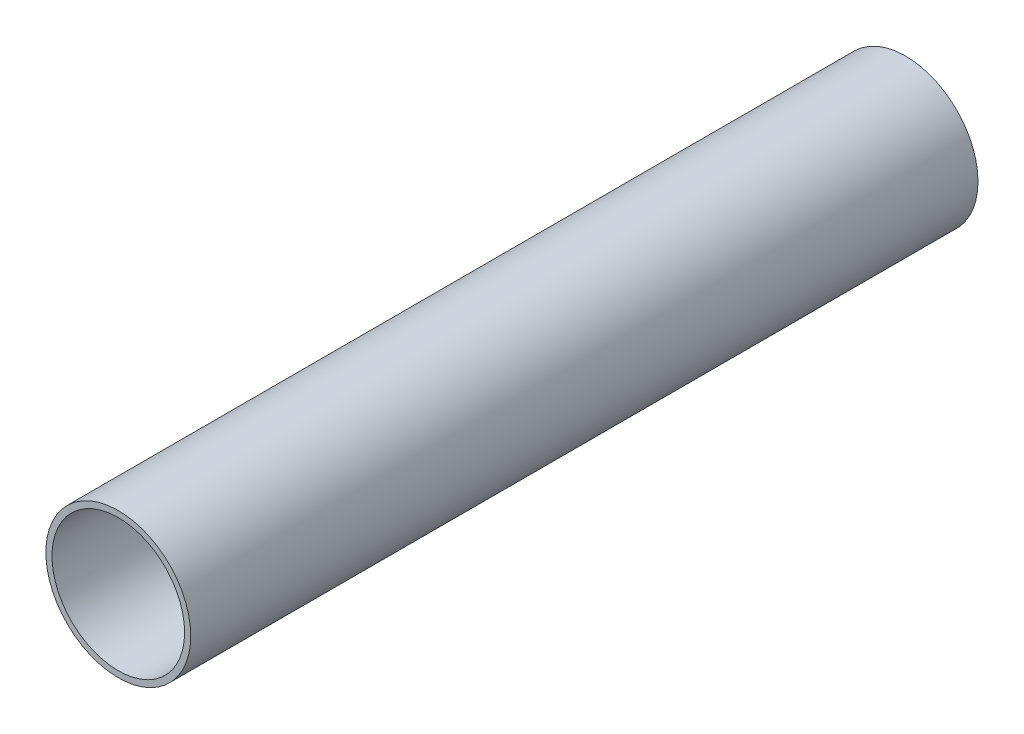
ISO-10303-21;
HEADER;
FILE_DESCRIPTION(('STEP AP214'),'2;1');
FILE_NAME('part.step','',(''),(''),'','','');
FILE_SCHEMA(('AUTOMOTIVE_DESIGN { 1 0 10303 214 1 1 1 1 }'));
ENDSEC;
DATA;
#1=APPLICATION_CONTEXT('core data for automotive mechanical design processes');
#2=APPLICATION_PROTOCOL_DEFINITION('international standard','automotive_design',2000,#1);
#3=PRODUCT_CONTEXT('',#1,'mechanical');
#4=PRODUCT('Part','Part','',(#3));
#5=PRODUCT_RELATED_PRODUCT_CATEGORY('part','',(#4));
#6=PRODUCT_DEFINITION_FORMATION('','',#4);
#7=PRODUCT_DEFINITION_CONTEXT('part definition',#1,'design');
#8=PRODUCT_DEFINITION('design','',#6,#7);
#9=PRODUCT_DEFINITION_SHAPE('','',#8);
#10=(LENGTH_UNIT() NAMED_UNIT(*) SI_UNIT(.MILLI.,.METRE.));
#11=(NAMED_UNIT(*) PLANE_ANGLE_UNIT() SI_UNIT($,.RADIAN.));
#12=(NAMED_UNIT(*) SI_UNIT($,.STERADIAN.) SOLID_ANGLE_UNIT());
#13=UNCERTAINTY_MEASURE_WITH_UNIT(LENGTH_MEASURE(1.E-05),#10,'distance_accuracy_value','');
#14=(GEOMETRIC_REPRESENTATION_CONTEXT(3) GLOBAL_UNCERTAINTY_ASSIGNED_CONTEXT((#13)) GLOBAL_UNIT_ASSIGNED_CONTEXT((#10,
#11,#12)) REPRESENTATION_CONTEXT('',''));
#15=CARTESIAN_POINT('',(0.,0.,0.));
#16=DIRECTION('',(0.,0.,1.));
#17=DIRECTION('',(1.,0.,0.));
#18=AXIS2_PLACEMENT_3D('',#15,#16,#17);
#19=CARTESIAN_POINT('',(0.,0.,457.2));
#20=DIRECTION('',(0.,0.,1.));
#21=DIRECTION('',(1.,0.,0.));
#22=AXIS2_PLACEMENT_3D('',#19,#20,#21);
#23=PLANE('',#22);
#24=CARTESIAN_POINT('',(0.,0.,457.2));
#25=DIRECTION('',(0.,0.,1.));
#26=DIRECTION('',(1.,0.,0.));
#27=AXIS2_PLACEMENT_3D('',#24,#25,#26);
#28=CIRCLE('',#27,84.1375);
#29=CARTESIAN_POINT('',(84.1375,0.,457.2));
#30=VERTEX_POINT('',#29);
#31=EDGE_CURVE('E11',#30,#30,#28,.T.);
#32=ORIENTED_EDGE('',*,*,#31,.T.);
#33=EDGE_LOOP('',(#32));
#34=FACE_BOUND('',#33,.T.);
#35=CARTESIAN_POINT('',(0.,0.,457.2));
#36=DIRECTION('',(0.,0.,1.));
#37=DIRECTION('',(1.,0.,0.));
#38=AXIS2_PLACEMENT_3D('',#35,#36,#37);
#39=CIRCLE('',#38,77.0255);
#40=CARTESIAN_POINT('',(77.0255,0.,457.2));
#41=VERTEX_POINT('',#40);
#42=EDGE_CURVE('E47',#41,#41,#39,.T.);
#43=ORIENTED_EDGE('',*,*,#42,.F.);
#44=EDGE_LOOP('',(#43));
#45=FACE_BOUND('',#44,.T.);
#46=ADVANCED_FACE('F36',(#34,#45),#23,.T.);
#47=CARTESIAN_POINT('',(0.,0.,-457.2));
#48=DIRECTION('',(0.,0.,1.));
#49=DIRECTION('',(1.,0.,0.));
#50=AXIS2_PLACEMENT_3D('',#47,#48,#49);
#51=PLANE('',#50);
#52=CARTESIAN_POINT('',(0.,0.,-457.2));
#53=DIRECTION('',(0.,0.,1.));
#54=DIRECTION('',(1.,0.,0.));
#55=AXIS2_PLACEMENT_3D('',#52,#53,#54);
#56=CIRCLE('',#55,84.1375);
#57=CARTESIAN_POINT('',(84.1375,0.,-457.2));
#58=VERTEX_POINT('',#57);
#59=EDGE_CURVE('E40',#58,#58,#56,.T.);
#60=ORIENTED_EDGE('',*,*,#59,.F.);
#61=EDGE_LOOP('',(#60));
#62=FACE_BOUND('',#61,.T.);
#63=CARTESIAN_POINT('',(0.,0.,-457.2));
#64=DIRECTION('',(0.,0.,1.));
#65=DIRECTION('',(1.,0.,0.));
#66=AXIS2_PLACEMENT_3D('',#63,#64,#65);
#67=CIRCLE('',#66,77.0255);
#68=CARTESIAN_POINT('',(77.0255,0.,-457.2));
#69=VERTEX_POINT('',#68);
#70=EDGE_CURVE('E49',#69,#69,#67,.T.);
#71=ORIENTED_EDGE('',*,*,#70,.T.);
#72=EDGE_LOOP('',(#71));
#73=FACE_BOUND('',#72,.T.);
#74=ADVANCED_FACE('F59',(#62,#73),#51,.F.);
#75=CARTESIAN_POINT('',(0.,0.,457.2));
#76=DIRECTION('',(0.,0.,-1.));
#77=DIRECTION('',(-1.,0.,0.));
#78=AXIS2_PLACEMENT_3D('',#75,#76,#77);
#79=CYLINDRICAL_SURFACE('',#78,84.1375);
#80=ORIENTED_EDGE('',*,*,#31,.F.);
#81=EDGE_LOOP('',(#80));
#82=FACE_BOUND('',#81,.T.);
#83=ORIENTED_EDGE('',*,*,#59,.T.);
#84=EDGE_LOOP('',(#83));
#85=FACE_BOUND('',#84,.T.);
#86=ADVANCED_FACE('F38',(#82,#85),#79,.T.);
#87=CARTESIAN_POINT('',(0.,0.,457.2));
#88=DIRECTION('',(0.,0.,-1.));
#89=DIRECTION('',(-1.,0.,0.));
#90=AXIS2_PLACEMENT_3D('',#87,#88,#89);
#91=CYLINDRICAL_SURFACE('',#90,77.0255);
#92=ORIENTED_EDGE('',*,*,#42,.T.);
#93=EDGE_LOOP('',(#92));
#94=FACE_BOUND('',#93,.T.);
#95=ORIENTED_EDGE('',*,*,#70,.F.);
#96=EDGE_LOOP('',(#95));
#97=FACE_BOUND('',#96,.T.);
#98=ADVANCED_FACE('F55',(#94,#97),#91,.F.);
#99=CLOSED_SHELL('',(#46,#74,#86,#98));
#100=MANIFOLD_SOLID_BREP('B2',#99);
#101=ADVANCED_BREP_SHAPE_REPRESENTATION('',(#18,#100),#14);
#102=SHAPE_DEFINITION_REPRESENTATION(#9,#101);
ENDSEC;
END-ISO-10303-21;
